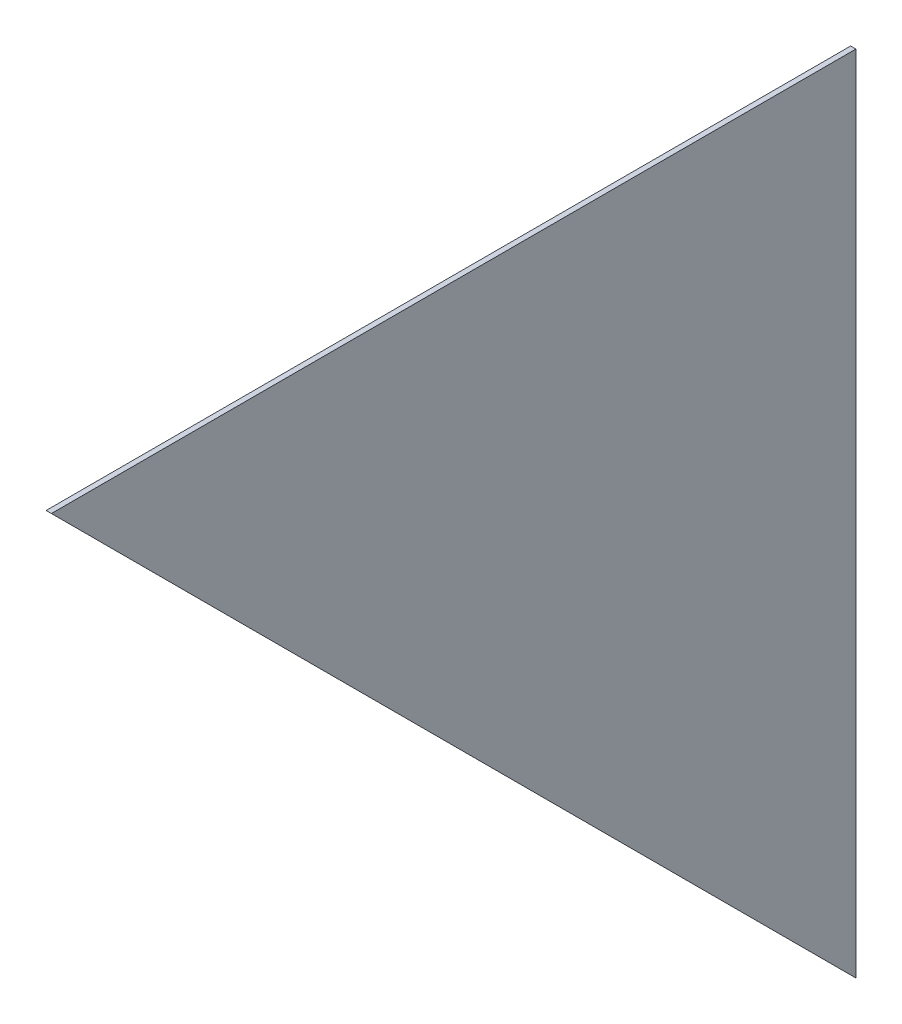
ISO-10303-21;
HEADER;
FILE_DESCRIPTION(('STEP AP214'),'2;1');
FILE_NAME('part.step','',(''),(''),'','','');
FILE_SCHEMA(('AUTOMOTIVE_DESIGN { 1 0 10303 214 1 1 1 1 }'));
ENDSEC;
DATA;
#1=APPLICATION_CONTEXT('core data for automotive mechanical design processes');
#2=APPLICATION_PROTOCOL_DEFINITION('international standard','automotive_design',2000,#1);
#3=PRODUCT_CONTEXT('',#1,'mechanical');
#4=PRODUCT('Part','Part','',(#3));
#5=PRODUCT_RELATED_PRODUCT_CATEGORY('part','',(#4));
#6=PRODUCT_DEFINITION_FORMATION('','',#4);
#7=PRODUCT_DEFINITION_CONTEXT('part definition',#1,'design');
#8=PRODUCT_DEFINITION('design','',#6,#7);
#9=PRODUCT_DEFINITION_SHAPE('','',#8);
#10=(LENGTH_UNIT() NAMED_UNIT(*) SI_UNIT(.MILLI.,.METRE.));
#11=(NAMED_UNIT(*) PLANE_ANGLE_UNIT() SI_UNIT($,.RADIAN.));
#12=(NAMED_UNIT(*) SI_UNIT($,.STERADIAN.) SOLID_ANGLE_UNIT());
#13=UNCERTAINTY_MEASURE_WITH_UNIT(LENGTH_MEASURE(1.E-05),#10,'distance_accuracy_value','');
#14=(GEOMETRIC_REPRESENTATION_CONTEXT(3) GLOBAL_UNCERTAINTY_ASSIGNED_CONTEXT((#13)) GLOBAL_UNIT_ASSIGNED_CONTEXT((#10,
#11,#12)) REPRESENTATION_CONTEXT('',''));
#15=CARTESIAN_POINT('',(0.,0.,0.));
#16=DIRECTION('',(0.,0.,1.));
#17=DIRECTION('',(1.,0.,0.));
#18=AXIS2_PLACEMENT_3D('',#15,#16,#17);
#19=CARTESIAN_POINT('',(26.9999999999994,625.000000000002,-1935.));
#20=DIRECTION('',(0.,0.,-1.));
#21=DIRECTION('',(-1.,0.,0.));
#22=AXIS2_PLACEMENT_3D('',#19,#20,#21);
#23=PLANE('',#22);
#24=DIRECTION('',(0.,-1.,0.));
#25=VECTOR('',#24,1.);
#26=CARTESIAN_POINT('',(24.9999999999994,625.000000000002,-1935.));
#27=LINE('',#26,#25);
#28=CARTESIAN_POINT('',(24.9999999999994,930.,-1935.));
#29=VERTEX_POINT('',#28);
#30=CARTESIAN_POINT('',(24.9999999999994,625.000000000002,-1935.));
#31=VERTEX_POINT('',#30);
#32=EDGE_CURVE('E88',#29,#31,#27,.T.);
#33=ORIENTED_EDGE('',*,*,#32,.F.);
#34=DIRECTION('',(-1.,0.,0.));
#35=VECTOR('',#34,1.);
#36=CARTESIAN_POINT('',(26.9999999999994,930.,-1935.));
#37=LINE('',#36,#35);
#38=CARTESIAN_POINT('',(26.9999999999994,930.,-1935.));
#39=VERTEX_POINT('',#38);
#40=EDGE_CURVE('E11',#39,#29,#37,.T.);
#41=ORIENTED_EDGE('',*,*,#40,.F.);
#42=DIRECTION('',(0.,-1.,0.));
#43=VECTOR('',#42,1.);
#44=CARTESIAN_POINT('',(26.9999999999994,625.000000000002,-1935.));
#45=LINE('',#44,#43);
#46=CARTESIAN_POINT('',(26.9999999999994,625.000000000002,-1935.));
#47=VERTEX_POINT('',#46);
#48=EDGE_CURVE('E80',#39,#47,#45,.T.);
#49=ORIENTED_EDGE('',*,*,#48,.T.);
#50=DIRECTION('',(-1.,0.,0.));
#51=VECTOR('',#50,1.);
#52=CARTESIAN_POINT('',(26.9999999999994,625.000000000002,-1935.));
#53=LINE('',#52,#51);
#54=EDGE_CURVE('E39',#47,#31,#53,.T.);
#55=ORIENTED_EDGE('',*,*,#54,.T.);
#56=EDGE_LOOP('',(#33,#41,#49,#55));
#57=FACE_BOUND('',#56,.T.);
#58=ADVANCED_FACE('F36',(#57),#23,.T.);
#59=CARTESIAN_POINT('',(26.9999999999994,930.,-1935.));
#60=DIRECTION('',(0.,1.,0.));
#61=DIRECTION('',(0.,0.,1.));
#62=AXIS2_PLACEMENT_3D('',#59,#60,#61);
#63=PLANE('',#62);
#64=DIRECTION('',(0.,0.,-1.));
#65=VECTOR('',#64,1.);
#66=CARTESIAN_POINT('',(24.9999999999994,930.,-1935.));
#67=LINE('',#66,#65);
#68=CARTESIAN_POINT('',(25.,930.,-1630.00000000001));
#69=VERTEX_POINT('',#68);
#70=EDGE_CURVE('E82',#69,#29,#67,.T.);
#71=ORIENTED_EDGE('',*,*,#70,.F.);
#72=DIRECTION('',(-1.,0.,0.));
#73=VECTOR('',#72,1.);
#74=CARTESIAN_POINT('',(27.,930.,-1630.00000000001));
#75=LINE('',#74,#73);
#76=CARTESIAN_POINT('',(27.,930.,-1630.00000000001));
#77=VERTEX_POINT('',#76);
#78=EDGE_CURVE('E45',#77,#69,#75,.T.);
#79=ORIENTED_EDGE('',*,*,#78,.F.);
#80=DIRECTION('',(0.,0.,-1.));
#81=VECTOR('',#80,1.);
#82=CARTESIAN_POINT('',(26.9999999999994,930.,-1935.));
#83=LINE('',#82,#81);
#84=EDGE_CURVE('E77',#77,#39,#83,.T.);
#85=ORIENTED_EDGE('',*,*,#84,.T.);
#86=ORIENTED_EDGE('',*,*,#40,.T.);
#87=EDGE_LOOP('',(#71,#79,#85,#86));
#88=FACE_BOUND('',#87,.T.);
#89=ADVANCED_FACE('F92',(#88),#63,.T.);
#90=CARTESIAN_POINT('',(27.,930.,-1630.00000000001));
#91=DIRECTION('',(0.,-0.707106781186549,0.707106781186549));
#92=DIRECTION('',(0.,-0.707106781186549,-0.707106781186549));
#93=AXIS2_PLACEMENT_3D('',#90,#91,#92);
#94=PLANE('',#93);
#95=DIRECTION('',(0.,0.707106781186549,0.707106781186549));
#96=VECTOR('',#95,1.);
#97=CARTESIAN_POINT('',(25.,930.,-1630.00000000001));
#98=LINE('',#97,#96);
#99=EDGE_CURVE('E75',#31,#69,#98,.T.);
#100=ORIENTED_EDGE('',*,*,#99,.F.);
#101=ORIENTED_EDGE('',*,*,#54,.F.);
#102=DIRECTION('',(0.,0.707106781186549,0.707106781186549));
#103=VECTOR('',#102,1.);
#104=CARTESIAN_POINT('',(27.,930.,-1630.00000000001));
#105=LINE('',#104,#103);
#106=EDGE_CURVE('E73',#47,#77,#105,.T.);
#107=ORIENTED_EDGE('',*,*,#106,.T.);
#108=ORIENTED_EDGE('',*,*,#78,.T.);
#109=EDGE_LOOP('',(#100,#101,#107,#108));
#110=FACE_BOUND('',#109,.T.);
#111=ADVANCED_FACE('F72',(#110),#94,.T.);
#112=CARTESIAN_POINT('',(27.0000000000002,-1.11022302462516E-13,3.05311331771918E-13));
#113=DIRECTION('',(1.,0.,0.));
#114=DIRECTION('',(0.,0.,-1.));
#115=AXIS2_PLACEMENT_3D('',#112,#113,#114);
#116=PLANE('',#115);
#117=ORIENTED_EDGE('',*,*,#48,.F.);
#118=ORIENTED_EDGE('',*,*,#84,.F.);
#119=ORIENTED_EDGE('',*,*,#106,.F.);
#120=EDGE_LOOP('',(#117,#118,#119));
#121=FACE_BOUND('',#120,.T.);
#122=ADVANCED_FACE('F79',(#121),#116,.T.);
#123=CARTESIAN_POINT('',(25.0000000000002,-1.11022302462516E-13,3.05311331771918E-13));
#124=DIRECTION('',(1.,0.,0.));
#125=DIRECTION('',(0.,0.,-1.));
#126=AXIS2_PLACEMENT_3D('',#123,#124,#125);
#127=PLANE('',#126);
#128=ORIENTED_EDGE('',*,*,#32,.T.);
#129=ORIENTED_EDGE('',*,*,#99,.T.);
#130=ORIENTED_EDGE('',*,*,#70,.T.);
#131=EDGE_LOOP('',(#128,#129,#130));
#132=FACE_BOUND('',#131,.T.);
#133=ADVANCED_FACE('F91',(#132),#127,.F.);
#134=CLOSED_SHELL('',(#58,#89,#111,#122,#133));
#135=MANIFOLD_SOLID_BREP('B2',#134);
#136=ADVANCED_BREP_SHAPE_REPRESENTATION('',(#18,#135),#14);
#137=SHAPE_DEFINITION_REPRESENTATION(#9,#136);
ENDSEC;
END-ISO-10303-21;
